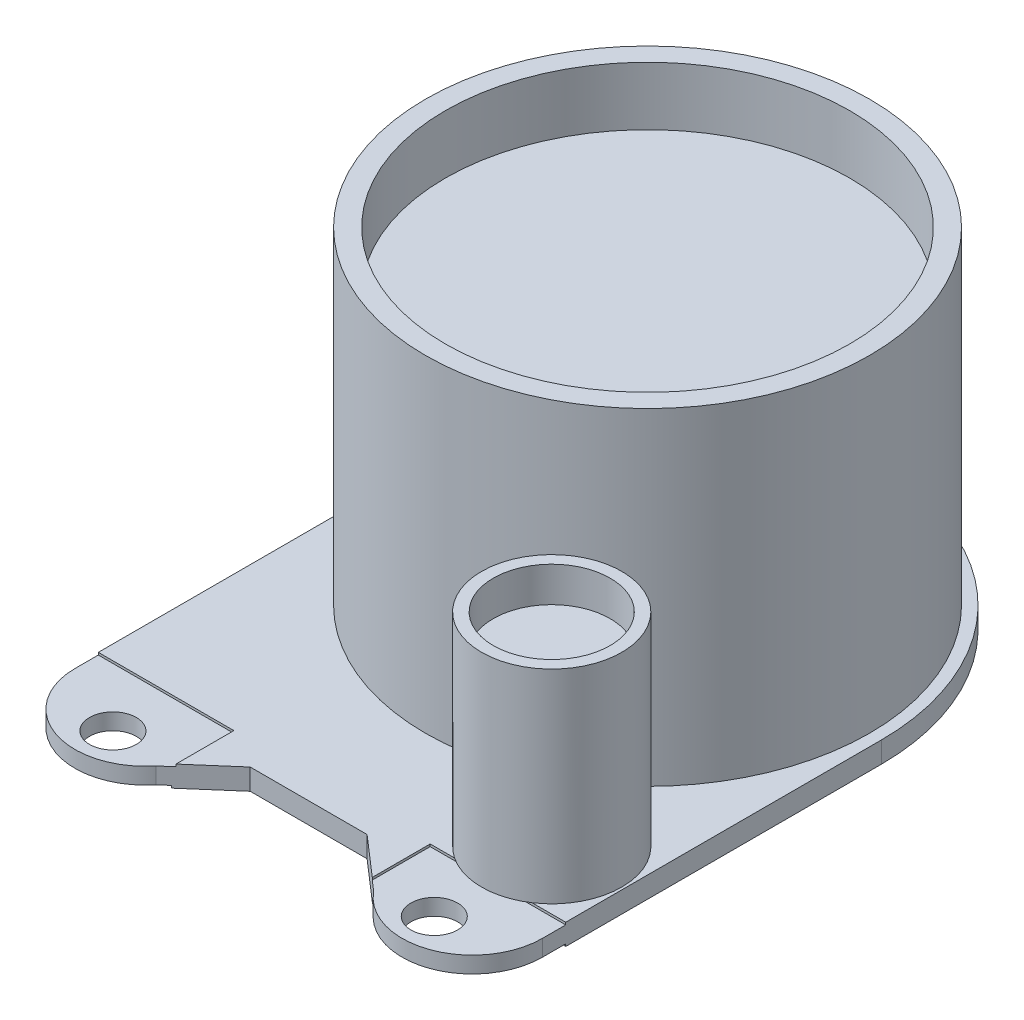
ISO-10303-21;
HEADER;
FILE_DESCRIPTION(('STEP AP214'),'2;1');
FILE_NAME('part.step','',(''),(''),'','','');
FILE_SCHEMA(('AUTOMOTIVE_DESIGN { 1 0 10303 214 1 1 1 1 }'));
ENDSEC;
DATA;
#1=APPLICATION_CONTEXT('core data for automotive mechanical design processes');
#2=APPLICATION_PROTOCOL_DEFINITION('international standard','automotive_design',2000,#1);
#3=PRODUCT_CONTEXT('',#1,'mechanical');
#4=PRODUCT('Part','Part','',(#3));
#5=PRODUCT_RELATED_PRODUCT_CATEGORY('part','',(#4));
#6=PRODUCT_DEFINITION_FORMATION('','',#4);
#7=PRODUCT_DEFINITION_CONTEXT('part definition',#1,'design');
#8=PRODUCT_DEFINITION('design','',#6,#7);
#9=PRODUCT_DEFINITION_SHAPE('','',#8);
#10=(LENGTH_UNIT() NAMED_UNIT(*) SI_UNIT(.MILLI.,.METRE.));
#11=(NAMED_UNIT(*) PLANE_ANGLE_UNIT() SI_UNIT($,.RADIAN.));
#12=(NAMED_UNIT(*) SI_UNIT($,.STERADIAN.) SOLID_ANGLE_UNIT());
#13=UNCERTAINTY_MEASURE_WITH_UNIT(LENGTH_MEASURE(1.E-05),#10,'distance_accuracy_value','');
#14=(GEOMETRIC_REPRESENTATION_CONTEXT(3) GLOBAL_UNCERTAINTY_ASSIGNED_CONTEXT((#13)) GLOBAL_UNIT_ASSIGNED_CONTEXT((#10,
#11,#12)) REPRESENTATION_CONTEXT('',''));
#15=CARTESIAN_POINT('',(0.,0.,0.));
#16=DIRECTION('',(0.,0.,1.));
#17=DIRECTION('',(1.,0.,0.));
#18=AXIS2_PLACEMENT_3D('',#15,#16,#17);
#19=CARTESIAN_POINT('',(-7.,0.9,14.5));
#20=DIRECTION('',(0.,-1.,0.));
#21=DIRECTION('',(0.,0.,-1.));
#22=AXIS2_PLACEMENT_3D('',#19,#20,#21);
#23=CYLINDRICAL_SURFACE('',#22,3.);
#24=CARTESIAN_POINT('',(-7.,0.8,14.5));
#25=DIRECTION('',(0.,1.,0.));
#26=DIRECTION('',(0.,0.,1.));
#27=AXIS2_PLACEMENT_3D('',#24,#25,#26);
#28=CIRCLE('',#27,3.);
#29=CARTESIAN_POINT('',(-10.,0.8,14.5));
#30=VERTEX_POINT('',#29);
#31=CARTESIAN_POINT('',(-4.66085191026748,0.8,16.3783999079804));
#32=VERTEX_POINT('',#31);
#33=EDGE_CURVE('E58',#30,#32,#28,.T.);
#34=ORIENTED_EDGE('',*,*,#33,.F.);
#35=DIRECTION('',(0.,-1.,0.));
#36=VECTOR('',#35,1.);
#37=CARTESIAN_POINT('',(-10.,0.9,14.5));
#38=LINE('',#37,#36);
#39=CARTESIAN_POINT('',(-10.,0.1,14.5));
#40=VERTEX_POINT('',#39);
#41=EDGE_CURVE('E372',#30,#40,#38,.T.);
#42=ORIENTED_EDGE('',*,*,#41,.T.);
#43=CARTESIAN_POINT('',(-7.,0.1,14.5));
#44=DIRECTION('',(0.,-1.,0.));
#45=DIRECTION('',(0.,0.,-1.));
#46=AXIS2_PLACEMENT_3D('',#43,#44,#45);
#47=CIRCLE('',#46,3.);
#48=CARTESIAN_POINT('',(-4.66085191026748,0.1,16.3783999079804));
#49=VERTEX_POINT('',#48);
#50=EDGE_CURVE('E299',#49,#40,#47,.T.);
#51=ORIENTED_EDGE('',*,*,#50,.F.);
#52=DIRECTION('',(0.,-1.,0.));
#53=VECTOR('',#52,1.);
#54=CARTESIAN_POINT('',(-4.66085191026748,0.9,16.3783999079804));
#55=LINE('',#54,#53);
#56=EDGE_CURVE('E370',#32,#49,#55,.T.);
#57=ORIENTED_EDGE('',*,*,#56,.F.);
#58=EDGE_LOOP('',(#34,#42,#51,#57));
#59=FACE_BOUND('',#58,.T.);
#60=ADVANCED_FACE('F43',(#59),#23,.T.);
#61=CARTESIAN_POINT('',(-6.875,0.9,16.));
#62=DIRECTION('',(0.,-1.,0.));
#63=DIRECTION('',(0.,0.,-1.));
#64=AXIS2_PLACEMENT_3D('',#61,#62,#63);
#65=CYLINDRICAL_SURFACE('',#64,1.);
#66=CARTESIAN_POINT('',(-6.875,0.1,16.));
#67=DIRECTION('',(0.,-1.,0.));
#68=DIRECTION('',(0.,0.,-1.));
#69=AXIS2_PLACEMENT_3D('',#66,#67,#68);
#70=CIRCLE('',#69,1.);
#71=CARTESIAN_POINT('',(-6.875,0.1,15.));
#72=VERTEX_POINT('',#71);
#73=EDGE_CURVE('E295',#72,#72,#70,.T.);
#74=ORIENTED_EDGE('',*,*,#73,.T.);
#75=EDGE_LOOP('',(#74));
#76=FACE_BOUND('',#75,.T.);
#77=CARTESIAN_POINT('',(-6.875,0.8,16.));
#78=DIRECTION('',(0.,1.,0.));
#79=DIRECTION('',(0.,0.,1.));
#80=AXIS2_PLACEMENT_3D('',#77,#78,#79);
#81=CIRCLE('',#80,1.);
#82=CARTESIAN_POINT('',(-6.875,0.8,17.));
#83=VERTEX_POINT('',#82);
#84=EDGE_CURVE('E244',#83,#83,#81,.T.);
#85=ORIENTED_EDGE('',*,*,#84,.T.);
#86=EDGE_LOOP('',(#85));
#87=FACE_BOUND('',#86,.T.);
#88=ADVANCED_FACE('F472',(#76,#87),#65,.F.);
#89=CARTESIAN_POINT('',(7.,0.9,14.5));
#90=DIRECTION('',(0.,-1.,0.));
#91=DIRECTION('',(0.,0.,-1.));
#92=AXIS2_PLACEMENT_3D('',#89,#90,#91);
#93=CYLINDRICAL_SURFACE('',#92,3.);
#94=DIRECTION('',(0.,-1.,0.));
#95=VECTOR('',#94,1.);
#96=CARTESIAN_POINT('',(10.,0.9,14.5));
#97=LINE('',#96,#95);
#98=CARTESIAN_POINT('',(10.,0.8,14.5));
#99=VERTEX_POINT('',#98);
#100=CARTESIAN_POINT('',(10.,0.1,14.5));
#101=VERTEX_POINT('',#100);
#102=EDGE_CURVE('E360',#99,#101,#97,.T.);
#103=ORIENTED_EDGE('',*,*,#102,.F.);
#104=CARTESIAN_POINT('',(7.,0.8,14.5));
#105=DIRECTION('',(0.,-1.,0.));
#106=DIRECTION('',(0.,0.,-1.));
#107=AXIS2_PLACEMENT_3D('',#104,#105,#106);
#108=CIRCLE('',#107,3.);
#109=CARTESIAN_POINT('',(4.66085191026748,0.8,16.3783999079804));
#110=VERTEX_POINT('',#109);
#111=EDGE_CURVE('E235',#99,#110,#108,.T.);
#112=ORIENTED_EDGE('',*,*,#111,.T.);
#113=DIRECTION('',(0.,-1.,0.));
#114=VECTOR('',#113,1.);
#115=CARTESIAN_POINT('',(4.66085191026748,0.9,16.3783999079804));
#116=LINE('',#115,#114);
#117=CARTESIAN_POINT('',(4.66085191026748,0.1,16.3783999079804));
#118=VERTEX_POINT('',#117);
#119=EDGE_CURVE('E362',#110,#118,#116,.T.);
#120=ORIENTED_EDGE('',*,*,#119,.T.);
#121=CARTESIAN_POINT('',(7.,0.1,14.5));
#122=DIRECTION('',(0.,-1.,0.));
#123=DIRECTION('',(0.,0.,-1.));
#124=AXIS2_PLACEMENT_3D('',#121,#122,#123);
#125=CIRCLE('',#124,3.);
#126=EDGE_CURVE('E289',#101,#118,#125,.T.);
#127=ORIENTED_EDGE('',*,*,#126,.F.);
#128=EDGE_LOOP('',(#103,#112,#120,#127));
#129=FACE_BOUND('',#128,.T.);
#130=ADVANCED_FACE('F438',(#129),#93,.T.);
#131=CARTESIAN_POINT('',(6.875,0.9,16.));
#132=DIRECTION('',(0.,-1.,0.));
#133=DIRECTION('',(0.,0.,-1.));
#134=AXIS2_PLACEMENT_3D('',#131,#132,#133);
#135=CYLINDRICAL_SURFACE('',#134,1.00000000000001);
#136=CARTESIAN_POINT('',(6.875,0.8,16.));
#137=DIRECTION('',(0.,-1.,0.));
#138=DIRECTION('',(0.,0.,-1.));
#139=AXIS2_PLACEMENT_3D('',#136,#137,#138);
#140=CIRCLE('',#139,1.00000000000001);
#141=CARTESIAN_POINT('',(6.875,0.8,15.));
#142=VERTEX_POINT('',#141);
#143=EDGE_CURVE('E239',#142,#142,#140,.T.);
#144=ORIENTED_EDGE('',*,*,#143,.F.);
#145=EDGE_LOOP('',(#144));
#146=FACE_BOUND('',#145,.T.);
#147=CARTESIAN_POINT('',(6.875,0.1,16.));
#148=DIRECTION('',(0.,-1.,0.));
#149=DIRECTION('',(0.,0.,-1.));
#150=AXIS2_PLACEMENT_3D('',#147,#148,#149);
#151=CIRCLE('',#150,1.00000000000001);
#152=CARTESIAN_POINT('',(6.875,0.1,15.));
#153=VERTEX_POINT('',#152);
#154=EDGE_CURVE('E264',#153,#153,#151,.T.);
#155=ORIENTED_EDGE('',*,*,#154,.T.);
#156=EDGE_LOOP('',(#155));
#157=FACE_BOUND('',#156,.T.);
#158=ADVANCED_FACE('F561',(#146,#157),#135,.F.);
#159=CARTESIAN_POINT('',(0.,0.9,0.));
#160=DIRECTION('',(0.,-1.,0.));
#161=DIRECTION('',(0.,0.,-1.));
#162=AXIS2_PLACEMENT_3D('',#159,#160,#161);
#163=PLANE('',#162);
#164=DIRECTION('',(0.,0.,1.));
#165=VECTOR('',#164,1.);
#166=CARTESIAN_POINT('',(-10.,0.9,0.));
#167=LINE('',#166,#165);
#168=CARTESIAN_POINT('',(-10.,0.9,0.));
#169=VERTEX_POINT('',#168);
#170=CARTESIAN_POINT('',(-10.,0.9,13.5));
#171=VERTEX_POINT('',#170);
#172=EDGE_CURVE('E331',#169,#171,#167,.T.);
#173=ORIENTED_EDGE('',*,*,#172,.T.);
#174=DIRECTION('',(-1.,0.,0.));
#175=VECTOR('',#174,1.);
#176=CARTESIAN_POINT('',(-10.,0.9,13.5));
#177=LINE('',#176,#175);
#178=CARTESIAN_POINT('',(-4.2,0.9,13.5));
#179=VERTEX_POINT('',#178);
#180=EDGE_CURVE('E211',#179,#171,#177,.T.);
#181=ORIENTED_EDGE('',*,*,#180,.F.);
#182=DIRECTION('',(0.,0.,-1.));
#183=VECTOR('',#182,1.);
#184=CARTESIAN_POINT('',(-4.2,0.9,13.5));
#185=LINE('',#184,#183);
#186=CARTESIAN_POINT('',(-4.2,0.9,15.9777874542876));
#187=VERTEX_POINT('',#186);
#188=EDGE_CURVE('E200',#187,#179,#185,.T.);
#189=ORIENTED_EDGE('',*,*,#188,.F.);
#190=DIRECTION('',(0.754709580222771,0.,-0.656059028990508));
#191=VECTOR('',#190,1.);
#192=CARTESIAN_POINT('',(-4.66085191026748,0.9,16.3783999079804));
#193=LINE('',#192,#191);
#194=CARTESIAN_POINT('',(-2.5,0.9,14.5));
#195=VERTEX_POINT('',#194);
#196=EDGE_CURVE('E335',#187,#195,#193,.T.);
#197=ORIENTED_EDGE('',*,*,#196,.T.);
#198=DIRECTION('',(1.,0.,0.));
#199=VECTOR('',#198,1.);
#200=CARTESIAN_POINT('',(-2.5,0.9,14.5));
#201=LINE('',#200,#199);
#202=CARTESIAN_POINT('',(2.5,0.9,14.5));
#203=VERTEX_POINT('',#202);
#204=EDGE_CURVE('E337',#195,#203,#201,.T.);
#205=ORIENTED_EDGE('',*,*,#204,.T.);
#206=DIRECTION('',(0.754709580222771,0.,0.656059028990509));
#207=VECTOR('',#206,1.);
#208=CARTESIAN_POINT('',(2.5,0.9,14.5));
#209=LINE('',#208,#207);
#210=CARTESIAN_POINT('',(4.2,0.9,15.9777874542876));
#211=VERTEX_POINT('',#210);
#212=EDGE_CURVE('E339',#203,#211,#209,.T.);
#213=ORIENTED_EDGE('',*,*,#212,.T.);
#214=DIRECTION('',(0.,0.,1.));
#215=VECTOR('',#214,1.);
#216=CARTESIAN_POINT('',(4.2,0.9,13.5));
#217=LINE('',#216,#215);
#218=CARTESIAN_POINT('',(4.2,0.9,13.5));
#219=VERTEX_POINT('',#218);
#220=EDGE_CURVE('E221',#219,#211,#217,.T.);
#221=ORIENTED_EDGE('',*,*,#220,.F.);
#222=DIRECTION('',(-1.,0.,0.));
#223=VECTOR('',#222,1.);
#224=CARTESIAN_POINT('',(10.,0.9,13.5));
#225=LINE('',#224,#223);
#226=CARTESIAN_POINT('',(5.2416876048223,0.9,13.5));
#227=VERTEX_POINT('',#226);
#228=EDGE_CURVE('E228',#227,#219,#225,.T.);
#229=ORIENTED_EDGE('',*,*,#228,.F.);
#230=CARTESIAN_POINT('',(6.9,0.9,11.));
#231=DIRECTION('',(0.,-1.,0.));
#232=DIRECTION('',(0.,0.,-1.));
#233=AXIS2_PLACEMENT_3D('',#230,#231,#232);
#234=CIRCLE('',#233,3.);
#235=CARTESIAN_POINT('',(8.55831239517769,0.9,13.5));
#236=VERTEX_POINT('',#235);
#237=EDGE_CURVE('E326',#236,#227,#234,.F.);
#238=ORIENTED_EDGE('',*,*,#237,.F.);
#239=CARTESIAN_POINT('',(10.,0.9,13.5));
#240=VERTEX_POINT('',#239);
#241=EDGE_CURVE('E67',#240,#236,#225,.T.);
#242=ORIENTED_EDGE('',*,*,#241,.F.);
#243=DIRECTION('',(0.,0.,-1.));
#244=VECTOR('',#243,1.);
#245=CARTESIAN_POINT('',(10.,0.9,0.));
#246=LINE('',#245,#244);
#247=CARTESIAN_POINT('',(10.,0.9,0.));
#248=VERTEX_POINT('',#247);
#249=EDGE_CURVE('E342',#240,#248,#246,.T.);
#250=ORIENTED_EDGE('',*,*,#249,.T.);
#251=CARTESIAN_POINT('',(0.,0.9,0.));
#252=DIRECTION('',(0.,1.,0.));
#253=DIRECTION('',(0.,0.,-1.));
#254=AXIS2_PLACEMENT_3D('',#251,#252,#253);
#255=CIRCLE('',#254,10.);
#256=EDGE_CURVE('E328',#248,#169,#255,.T.);
#257=ORIENTED_EDGE('',*,*,#256,.T.);
#258=EDGE_LOOP('',(#173,#181,#189,#197,#205,#213,#221,#229,#238,#242,#250,#257));
#259=FACE_BOUND('',#258,.T.);
#260=CARTESIAN_POINT('',(0.,0.9,0.));
#261=DIRECTION('',(0.,1.,0.));
#262=DIRECTION('',(0.,0.,1.));
#263=AXIS2_PLACEMENT_3D('',#260,#261,#262);
#264=CIRCLE('',#263,9.5);
#265=CARTESIAN_POINT('',(0.,0.9,9.5));
#266=VERTEX_POINT('',#265);
#267=EDGE_CURVE('E323',#266,#266,#264,.T.);
#268=ORIENTED_EDGE('',*,*,#267,.F.);
#269=EDGE_LOOP('',(#268));
#270=FACE_BOUND('',#269,.T.);
#271=ADVANCED_FACE('F404',(#259,#270),#163,.F.);
#272=CARTESIAN_POINT('',(0.,0.,0.));
#273=DIRECTION('',(0.,-1.,0.));
#274=DIRECTION('',(0.,0.,-1.));
#275=AXIS2_PLACEMENT_3D('',#272,#273,#274);
#276=PLANE('',#275);
#277=DIRECTION('',(0.,0.,1.));
#278=VECTOR('',#277,1.);
#279=CARTESIAN_POINT('',(-4.3,0.,18.5));
#280=LINE('',#279,#278);
#281=CARTESIAN_POINT('',(-4.3,0.,13.5));
#282=VERTEX_POINT('',#281);
#283=CARTESIAN_POINT('',(-4.3,0.,16.0647161280692));
#284=VERTEX_POINT('',#283);
#285=EDGE_CURVE('E251',#282,#284,#280,.T.);
#286=ORIENTED_EDGE('',*,*,#285,.F.);
#287=DIRECTION('',(1.,0.,0.));
#288=VECTOR('',#287,1.);
#289=CARTESIAN_POINT('',(-10.,0.,13.5));
#290=LINE('',#289,#288);
#291=CARTESIAN_POINT('',(-10.,0.,13.5));
#292=VERTEX_POINT('',#291);
#293=EDGE_CURVE('E257',#292,#282,#290,.T.);
#294=ORIENTED_EDGE('',*,*,#293,.F.);
#295=DIRECTION('',(0.,0.,1.));
#296=VECTOR('',#295,1.);
#297=CARTESIAN_POINT('',(-10.,0.,0.));
#298=LINE('',#297,#296);
#299=CARTESIAN_POINT('',(-10.,0.,0.));
#300=VERTEX_POINT('',#299);
#301=EDGE_CURVE('E347',#300,#292,#298,.T.);
#302=ORIENTED_EDGE('',*,*,#301,.F.);
#303=CARTESIAN_POINT('',(0.,0.,0.));
#304=DIRECTION('',(0.,1.,0.));
#305=DIRECTION('',(0.,0.,-1.));
#306=AXIS2_PLACEMENT_3D('',#303,#304,#305);
#307=CIRCLE('',#306,10.);
#308=CARTESIAN_POINT('',(10.,0.,0.));
#309=VERTEX_POINT('',#308);
#310=EDGE_CURVE('E322',#309,#300,#307,.T.);
#311=ORIENTED_EDGE('',*,*,#310,.F.);
#312=DIRECTION('',(0.,0.,-1.));
#313=VECTOR('',#312,1.);
#314=CARTESIAN_POINT('',(10.,0.,0.));
#315=LINE('',#314,#313);
#316=CARTESIAN_POINT('',(10.,0.,13.5));
#317=VERTEX_POINT('',#316);
#318=EDGE_CURVE('E332',#317,#309,#315,.T.);
#319=ORIENTED_EDGE('',*,*,#318,.F.);
#320=DIRECTION('',(1.,0.,0.));
#321=VECTOR('',#320,1.);
#322=CARTESIAN_POINT('',(4.3,0.,13.5));
#323=LINE('',#322,#321);
#324=CARTESIAN_POINT('',(4.3,0.,13.5));
#325=VERTEX_POINT('',#324);
#326=EDGE_CURVE('E269',#325,#317,#323,.T.);
#327=ORIENTED_EDGE('',*,*,#326,.F.);
#328=DIRECTION('',(0.,0.,-1.));
#329=VECTOR('',#328,1.);
#330=CARTESIAN_POINT('',(4.3,0.,18.5));
#331=LINE('',#330,#329);
#332=CARTESIAN_POINT('',(4.3,0.,16.0647161280692));
#333=VERTEX_POINT('',#332);
#334=EDGE_CURVE('E276',#333,#325,#331,.T.);
#335=ORIENTED_EDGE('',*,*,#334,.F.);
#336=DIRECTION('',(0.754709580222771,0.,0.656059028990509));
#337=VECTOR('',#336,1.);
#338=CARTESIAN_POINT('',(2.5,0.,14.5));
#339=LINE('',#338,#337);
#340=CARTESIAN_POINT('',(2.5,0.,14.5));
#341=VERTEX_POINT('',#340);
#342=EDGE_CURVE('E354',#341,#333,#339,.T.);
#343=ORIENTED_EDGE('',*,*,#342,.F.);
#344=DIRECTION('',(1.,0.,0.));
#345=VECTOR('',#344,1.);
#346=CARTESIAN_POINT('',(-2.5,0.,14.5));
#347=LINE('',#346,#345);
#348=CARTESIAN_POINT('',(-2.5,0.,14.5));
#349=VERTEX_POINT('',#348);
#350=EDGE_CURVE('E352',#349,#341,#347,.T.);
#351=ORIENTED_EDGE('',*,*,#350,.F.);
#352=DIRECTION('',(0.754709580222771,0.,-0.656059028990508));
#353=VECTOR('',#352,1.);
#354=CARTESIAN_POINT('',(-4.66085191026748,0.,16.3783999079804));
#355=LINE('',#354,#353);
#356=EDGE_CURVE('E350',#284,#349,#355,.T.);
#357=ORIENTED_EDGE('',*,*,#356,.F.);
#358=EDGE_LOOP('',(#286,#294,#302,#311,#319,#327,#335,#343,#351,#357));
#359=FACE_BOUND('',#358,.T.);
#360=CARTESIAN_POINT('',(0.,0.,0.));
#361=DIRECTION('',(0.,-1.,0.));
#362=DIRECTION('',(0.,0.,-1.));
#363=AXIS2_PLACEMENT_3D('',#360,#361,#362);
#364=CIRCLE('',#363,4.25);
#365=CARTESIAN_POINT('',(0.,0.,-4.25));
#366=VERTEX_POINT('',#365);
#367=EDGE_CURVE('E247',#366,#366,#364,.T.);
#368=ORIENTED_EDGE('',*,*,#367,.F.);
#369=EDGE_LOOP('',(#368));
#370=FACE_BOUND('',#369,.T.);
#371=ADVANCED_FACE('F418',(#359,#370),#276,.T.);
#372=CARTESIAN_POINT('',(0.,0.9,0.));
#373=DIRECTION('',(0.,-1.,0.));
#374=DIRECTION('',(0.,0.,-1.));
#375=AXIS2_PLACEMENT_3D('',#372,#373,#374);
#376=CYLINDRICAL_SURFACE('',#375,10.);
#377=ORIENTED_EDGE('',*,*,#310,.T.);
#378=DIRECTION('',(0.,-1.,0.));
#379=VECTOR('',#378,1.);
#380=CARTESIAN_POINT('',(-10.,0.9,0.));
#381=LINE('',#380,#379);
#382=EDGE_CURVE('E327',#169,#300,#381,.T.);
#383=ORIENTED_EDGE('',*,*,#382,.F.);
#384=ORIENTED_EDGE('',*,*,#256,.F.);
#385=DIRECTION('',(0.,-1.,0.));
#386=VECTOR('',#385,1.);
#387=CARTESIAN_POINT('',(10.,0.9,0.));
#388=LINE('',#387,#386);
#389=EDGE_CURVE('E344',#248,#309,#388,.T.);
#390=ORIENTED_EDGE('',*,*,#389,.T.);
#391=EDGE_LOOP('',(#377,#383,#384,#390));
#392=FACE_BOUND('',#391,.T.);
#393=ADVANCED_FACE('F45',(#392),#376,.T.);
#394=CARTESIAN_POINT('',(-10.,0.9,0.));
#395=DIRECTION('',(1.,0.,0.));
#396=DIRECTION('',(0.,0.,-1.));
#397=AXIS2_PLACEMENT_3D('',#394,#395,#396);
#398=PLANE('',#397);
#399=DIRECTION('',(0.,0.,1.));
#400=VECTOR('',#399,1.);
#401=CARTESIAN_POINT('',(-10.,0.8,13.5));
#402=LINE('',#401,#400);
#403=CARTESIAN_POINT('',(-10.,0.8,13.5));
#404=VERTEX_POINT('',#403);
#405=EDGE_CURVE('E194',#404,#30,#402,.T.);
#406=ORIENTED_EDGE('',*,*,#405,.F.);
#407=DIRECTION('',(0.,1.,0.));
#408=VECTOR('',#407,1.);
#409=CARTESIAN_POINT('',(-10.,0.8,13.5));
#410=LINE('',#409,#408);
#411=EDGE_CURVE('E203',#404,#171,#410,.T.);
#412=ORIENTED_EDGE('',*,*,#411,.T.);
#413=ORIENTED_EDGE('',*,*,#172,.F.);
#414=ORIENTED_EDGE('',*,*,#382,.T.);
#415=ORIENTED_EDGE('',*,*,#301,.T.);
#416=DIRECTION('',(0.,-1.,0.));
#417=VECTOR('',#416,1.);
#418=CARTESIAN_POINT('',(-10.,0.1,13.5));
#419=LINE('',#418,#417);
#420=CARTESIAN_POINT('',(-10.,0.1,13.5));
#421=VERTEX_POINT('',#420);
#422=EDGE_CURVE('E256',#421,#292,#419,.T.);
#423=ORIENTED_EDGE('',*,*,#422,.F.);
#424=DIRECTION('',(0.,0.,-1.));
#425=VECTOR('',#424,1.);
#426=CARTESIAN_POINT('',(-10.,0.1,18.5));
#427=LINE('',#426,#425);
#428=EDGE_CURVE('E248',#40,#421,#427,.T.);
#429=ORIENTED_EDGE('',*,*,#428,.F.);
#430=ORIENTED_EDGE('',*,*,#41,.F.);
#431=EDGE_LOOP('',(#406,#412,#413,#414,#415,#423,#429,#430));
#432=FACE_BOUND('',#431,.T.);
#433=ADVANCED_FACE('F483',(#432),#398,.F.);
#434=CARTESIAN_POINT('',(-4.66085191026748,0.9,16.3783999079804));
#435=DIRECTION('',(-0.656059028990508,0.,-0.754709580222771));
#436=DIRECTION('',(-0.754709580222771,0.,0.656059028990508));
#437=AXIS2_PLACEMENT_3D('',#434,#435,#436);
#438=PLANE('',#437);
#439=ORIENTED_EDGE('',*,*,#196,.F.);
#440=DIRECTION('',(0.,-1.,0.));
#441=VECTOR('',#440,1.);
#442=CARTESIAN_POINT('',(-4.2,0.9,15.9777874542876));
#443=LINE('',#442,#441);
#444=CARTESIAN_POINT('',(-4.2,0.8,15.9777874542876));
#445=VERTEX_POINT('',#444);
#446=EDGE_CURVE('E11',#187,#445,#443,.T.);
#447=ORIENTED_EDGE('',*,*,#446,.T.);
#448=DIRECTION('',(0.754709580222771,0.,-0.656059028990508));
#449=VECTOR('',#448,1.);
#450=CARTESIAN_POINT('',(-4.66085191026748,0.8,16.3783999079804));
#451=LINE('',#450,#449);
#452=EDGE_CURVE('E51',#32,#445,#451,.T.);
#453=ORIENTED_EDGE('',*,*,#452,.F.);
#454=ORIENTED_EDGE('',*,*,#56,.T.);
#455=DIRECTION('',(-0.754709580222771,0.,0.656059028990508));
#456=VECTOR('',#455,1.);
#457=CARTESIAN_POINT('',(-4.66085191026748,0.1,16.3783999079804));
#458=LINE('',#457,#456);
#459=CARTESIAN_POINT('',(-4.3,0.1,16.0647161280692));
#460=VERTEX_POINT('',#459);
#461=EDGE_CURVE('E296',#460,#49,#458,.T.);
#462=ORIENTED_EDGE('',*,*,#461,.F.);
#463=DIRECTION('',(0.,-1.,0.));
#464=VECTOR('',#463,1.);
#465=CARTESIAN_POINT('',(-4.3,0.9,16.0647161280692));
#466=LINE('',#465,#464);
#467=EDGE_CURVE('E388',#460,#284,#466,.T.);
#468=ORIENTED_EDGE('',*,*,#467,.T.);
#469=ORIENTED_EDGE('',*,*,#356,.T.);
#470=DIRECTION('',(0.,-1.,0.));
#471=VECTOR('',#470,1.);
#472=CARTESIAN_POINT('',(-2.5,0.9,14.5));
#473=LINE('',#472,#471);
#474=EDGE_CURVE('E367',#195,#349,#473,.T.);
#475=ORIENTED_EDGE('',*,*,#474,.F.);
#476=EDGE_LOOP('',(#439,#447,#453,#454,#462,#468,#469,#475));
#477=FACE_BOUND('',#476,.T.);
#478=ADVANCED_FACE('F481',(#477),#438,.F.);
#479=CARTESIAN_POINT('',(-2.5,0.9,14.5));
#480=DIRECTION('',(0.,0.,-1.));
#481=DIRECTION('',(-1.,0.,0.));
#482=AXIS2_PLACEMENT_3D('',#479,#480,#481);
#483=PLANE('',#482);
#484=ORIENTED_EDGE('',*,*,#350,.T.);
#485=DIRECTION('',(0.,-1.,0.));
#486=VECTOR('',#485,1.);
#487=CARTESIAN_POINT('',(2.5,0.9,14.5));
#488=LINE('',#487,#486);
#489=EDGE_CURVE('E364',#203,#341,#488,.T.);
#490=ORIENTED_EDGE('',*,*,#489,.F.);
#491=ORIENTED_EDGE('',*,*,#204,.F.);
#492=ORIENTED_EDGE('',*,*,#474,.T.);
#493=EDGE_LOOP('',(#484,#490,#491,#492));
#494=FACE_BOUND('',#493,.T.);
#495=ADVANCED_FACE('F412',(#494),#483,.F.);
#496=CARTESIAN_POINT('',(2.5,0.9,14.5));
#497=DIRECTION('',(0.656059028990509,0.,-0.754709580222771));
#498=DIRECTION('',(-0.754709580222771,0.,-0.656059028990509));
#499=AXIS2_PLACEMENT_3D('',#496,#497,#498);
#500=PLANE('',#499);
#501=DIRECTION('',(-0.754709580222771,0.,-0.656059028990509));
#502=VECTOR('',#501,1.);
#503=CARTESIAN_POINT('',(2.5,0.8,14.5));
#504=LINE('',#503,#502);
#505=CARTESIAN_POINT('',(4.2,0.8,15.9777874542876));
#506=VERTEX_POINT('',#505);
#507=EDGE_CURVE('E214',#110,#506,#504,.T.);
#508=ORIENTED_EDGE('',*,*,#507,.T.);
#509=DIRECTION('',(0.,1.,0.));
#510=VECTOR('',#509,1.);
#511=CARTESIAN_POINT('',(4.2,0.9,15.9777874542876));
#512=LINE('',#511,#510);
#513=EDGE_CURVE('E394',#506,#211,#512,.T.);
#514=ORIENTED_EDGE('',*,*,#513,.T.);
#515=ORIENTED_EDGE('',*,*,#212,.F.);
#516=ORIENTED_EDGE('',*,*,#489,.T.);
#517=ORIENTED_EDGE('',*,*,#342,.T.);
#518=DIRECTION('',(0.,1.,0.));
#519=VECTOR('',#518,1.);
#520=CARTESIAN_POINT('',(4.3,0.9,16.0647161280692));
#521=LINE('',#520,#519);
#522=CARTESIAN_POINT('',(4.3,0.1,16.0647161280692));
#523=VERTEX_POINT('',#522);
#524=EDGE_CURVE('E380',#333,#523,#521,.T.);
#525=ORIENTED_EDGE('',*,*,#524,.T.);
#526=DIRECTION('',(-0.754709580222771,0.,-0.656059028990509));
#527=VECTOR('',#526,1.);
#528=CARTESIAN_POINT('',(2.5,0.1,14.5));
#529=LINE('',#528,#527);
#530=EDGE_CURVE('E293',#118,#523,#529,.T.);
#531=ORIENTED_EDGE('',*,*,#530,.F.);
#532=ORIENTED_EDGE('',*,*,#119,.F.);
#533=EDGE_LOOP('',(#508,#514,#515,#516,#517,#525,#531,#532));
#534=FACE_BOUND('',#533,.T.);
#535=ADVANCED_FACE('F398',(#534),#500,.F.);
#536=CARTESIAN_POINT('',(10.,0.9,0.));
#537=DIRECTION('',(-1.,0.,0.));
#538=DIRECTION('',(0.,0.,1.));
#539=AXIS2_PLACEMENT_3D('',#536,#537,#538);
#540=PLANE('',#539);
#541=ORIENTED_EDGE('',*,*,#249,.F.);
#542=DIRECTION('',(0.,1.,0.));
#543=VECTOR('',#542,1.);
#544=CARTESIAN_POINT('',(10.,0.8,13.5));
#545=LINE('',#544,#543);
#546=CARTESIAN_POINT('',(10.,0.8,13.5));
#547=VERTEX_POINT('',#546);
#548=EDGE_CURVE('E224',#547,#240,#545,.T.);
#549=ORIENTED_EDGE('',*,*,#548,.F.);
#550=DIRECTION('',(0.,0.,1.));
#551=VECTOR('',#550,1.);
#552=CARTESIAN_POINT('',(10.,0.8,0.));
#553=LINE('',#552,#551);
#554=EDGE_CURVE('E391',#547,#99,#553,.T.);
#555=ORIENTED_EDGE('',*,*,#554,.T.);
#556=ORIENTED_EDGE('',*,*,#102,.T.);
#557=DIRECTION('',(0.,0.,1.));
#558=VECTOR('',#557,1.);
#559=CARTESIAN_POINT('',(10.,0.1,18.5));
#560=LINE('',#559,#558);
#561=CARTESIAN_POINT('',(10.,0.1,13.5));
#562=VERTEX_POINT('',#561);
#563=EDGE_CURVE('E272',#562,#101,#560,.T.);
#564=ORIENTED_EDGE('',*,*,#563,.F.);
#565=DIRECTION('',(0.,-1.,0.));
#566=VECTOR('',#565,1.);
#567=CARTESIAN_POINT('',(10.,0.1,13.5));
#568=LINE('',#567,#566);
#569=EDGE_CURVE('E260',#562,#317,#568,.T.);
#570=ORIENTED_EDGE('',*,*,#569,.T.);
#571=ORIENTED_EDGE('',*,*,#318,.T.);
#572=ORIENTED_EDGE('',*,*,#389,.F.);
#573=EDGE_LOOP('',(#541,#549,#555,#556,#564,#570,#571,#572));
#574=FACE_BOUND('',#573,.T.);
#575=ADVANCED_FACE('F445',(#574),#540,.F.);
#576=CARTESIAN_POINT('',(0.,14.9,0.));
#577=DIRECTION('',(0.,-1.,0.));
#578=DIRECTION('',(0.,0.,-1.));
#579=AXIS2_PLACEMENT_3D('',#576,#577,#578);
#580=CYLINDRICAL_SURFACE('',#579,9.5);
#581=CARTESIAN_POINT('',(0.,14.9,0.));
#582=DIRECTION('',(0.,1.,0.));
#583=DIRECTION('',(0.,0.,1.));
#584=AXIS2_PLACEMENT_3D('',#581,#582,#583);
#585=CIRCLE('',#584,9.5);
#586=CARTESIAN_POINT('',(0.,14.9,9.5));
#587=VERTEX_POINT('',#586);
#588=EDGE_CURVE('E317',#587,#587,#585,.T.);
#589=ORIENTED_EDGE('',*,*,#588,.F.);
#590=EDGE_LOOP('',(#589));
#591=FACE_BOUND('',#590,.T.);
#592=ORIENTED_EDGE('',*,*,#267,.T.);
#593=EDGE_LOOP('',(#592));
#594=FACE_BOUND('',#593,.T.);
#595=ADVANCED_FACE('F556',(#591,#594),#580,.T.);
#596=CARTESIAN_POINT('',(0.,14.9,0.));
#597=DIRECTION('',(0.,1.,0.));
#598=DIRECTION('',(0.,0.,1.));
#599=AXIS2_PLACEMENT_3D('',#596,#597,#598);
#600=PLANE('',#599);
#601=CARTESIAN_POINT('',(0.,14.9,0.));
#602=DIRECTION('',(0.,1.,0.));
#603=DIRECTION('',(0.,0.,1.));
#604=AXIS2_PLACEMENT_3D('',#601,#602,#603);
#605=CIRCLE('',#604,8.65);
#606=CARTESIAN_POINT('',(0.,14.9,8.65));
#607=VERTEX_POINT('',#606);
#608=EDGE_CURVE('E313',#607,#607,#605,.T.);
#609=ORIENTED_EDGE('',*,*,#608,.F.);
#610=EDGE_LOOP('',(#609));
#611=FACE_BOUND('',#610,.T.);
#612=ORIENTED_EDGE('',*,*,#588,.T.);
#613=EDGE_LOOP('',(#612));
#614=FACE_BOUND('',#613,.T.);
#615=ADVANCED_FACE('F552',(#611,#614),#600,.T.);
#616=CARTESIAN_POINT('',(0.,12.4,0.));
#617=DIRECTION('',(0.,1.,0.));
#618=DIRECTION('',(0.,0.,1.));
#619=AXIS2_PLACEMENT_3D('',#616,#617,#618);
#620=CYLINDRICAL_SURFACE('',#619,8.65);
#621=CARTESIAN_POINT('',(0.,12.4,0.));
#622=DIRECTION('',(0.,1.,0.));
#623=DIRECTION('',(0.,0.,1.));
#624=AXIS2_PLACEMENT_3D('',#621,#622,#623);
#625=CIRCLE('',#624,8.65);
#626=CARTESIAN_POINT('',(0.,12.4,8.65));
#627=VERTEX_POINT('',#626);
#628=EDGE_CURVE('E314',#627,#627,#625,.T.);
#629=ORIENTED_EDGE('',*,*,#628,.F.);
#630=EDGE_LOOP('',(#629));
#631=FACE_BOUND('',#630,.T.);
#632=ORIENTED_EDGE('',*,*,#608,.T.);
#633=EDGE_LOOP('',(#632));
#634=FACE_BOUND('',#633,.T.);
#635=ADVANCED_FACE('F548',(#631,#634),#620,.F.);
#636=CARTESIAN_POINT('',(0.,12.4,0.));
#637=DIRECTION('',(0.,1.,0.));
#638=DIRECTION('',(0.,0.,1.));
#639=AXIS2_PLACEMENT_3D('',#636,#637,#638);
#640=PLANE('',#639);
#641=ORIENTED_EDGE('',*,*,#628,.T.);
#642=EDGE_LOOP('',(#641));
#643=FACE_BOUND('',#642,.T.);
#644=ADVANCED_FACE('F544',(#643),#640,.T.);
#645=CARTESIAN_POINT('',(6.9,9.6,11.));
#646=DIRECTION('',(0.,-1.,0.));
#647=DIRECTION('',(0.,0.,-1.));
#648=AXIS2_PLACEMENT_3D('',#645,#646,#647);
#649=CYLINDRICAL_SURFACE('',#648,3.);
#650=CARTESIAN_POINT('',(6.9,9.6,11.));
#651=DIRECTION('',(0.,1.,0.));
#652=DIRECTION('',(0.,0.,1.));
#653=AXIS2_PLACEMENT_3D('',#650,#651,#652);
#654=CIRCLE('',#653,3.);
#655=CARTESIAN_POINT('',(6.9,9.6,14.));
#656=VERTEX_POINT('',#655);
#657=EDGE_CURVE('E307',#656,#656,#654,.T.);
#658=ORIENTED_EDGE('',*,*,#657,.F.);
#659=EDGE_LOOP('',(#658));
#660=FACE_BOUND('',#659,.T.);
#661=EDGE_CURVE('E376',#227,#236,#234,.F.);
#662=ORIENTED_EDGE('',*,*,#661,.T.);
#663=ORIENTED_EDGE('',*,*,#237,.T.);
#664=EDGE_LOOP('',(#662,#663));
#665=FACE_BOUND('',#664,.T.);
#666=ADVANCED_FACE('F452',(#660,#665),#649,.T.);
#667=CARTESIAN_POINT('',(6.9,9.6,11.));
#668=DIRECTION('',(0.,1.,0.));
#669=DIRECTION('',(0.,0.,1.));
#670=AXIS2_PLACEMENT_3D('',#667,#668,#669);
#671=PLANE('',#670);
#672=CARTESIAN_POINT('',(6.9,9.6,11.));
#673=DIRECTION('',(0.,1.,0.));
#674=DIRECTION('',(0.,0.,1.));
#675=AXIS2_PLACEMENT_3D('',#672,#673,#674);
#676=CIRCLE('',#675,2.5);
#677=CARTESIAN_POINT('',(6.9,9.6,13.5));
#678=VERTEX_POINT('',#677);
#679=EDGE_CURVE('E302',#678,#678,#676,.T.);
#680=ORIENTED_EDGE('',*,*,#679,.F.);
#681=EDGE_LOOP('',(#680));
#682=FACE_BOUND('',#681,.T.);
#683=ORIENTED_EDGE('',*,*,#657,.T.);
#684=EDGE_LOOP('',(#683));
#685=FACE_BOUND('',#684,.T.);
#686=ADVANCED_FACE('F537',(#682,#685),#671,.T.);
#687=CARTESIAN_POINT('',(6.9,8.1,11.));
#688=DIRECTION('',(0.,1.,0.));
#689=DIRECTION('',(0.,0.,1.));
#690=AXIS2_PLACEMENT_3D('',#687,#688,#689);
#691=CYLINDRICAL_SURFACE('',#690,2.5);
#692=CARTESIAN_POINT('',(6.9,8.1,11.));
#693=DIRECTION('',(0.,1.,0.));
#694=DIRECTION('',(0.,0.,1.));
#695=AXIS2_PLACEMENT_3D('',#692,#693,#694);
#696=CIRCLE('',#695,2.5);
#697=CARTESIAN_POINT('',(6.9,8.1,13.5));
#698=VERTEX_POINT('',#697);
#699=EDGE_CURVE('E303',#698,#698,#696,.T.);
#700=ORIENTED_EDGE('',*,*,#699,.F.);
#701=EDGE_LOOP('',(#700));
#702=FACE_BOUND('',#701,.T.);
#703=ORIENTED_EDGE('',*,*,#679,.T.);
#704=EDGE_LOOP('',(#703));
#705=FACE_BOUND('',#704,.T.);
#706=ADVANCED_FACE('F533',(#702,#705),#691,.F.);
#707=CARTESIAN_POINT('',(6.9,8.1,11.));
#708=DIRECTION('',(0.,1.,0.));
#709=DIRECTION('',(0.,0.,1.));
#710=AXIS2_PLACEMENT_3D('',#707,#708,#709);
#711=PLANE('',#710);
#712=ORIENTED_EDGE('',*,*,#699,.T.);
#713=EDGE_LOOP('',(#712));
#714=FACE_BOUND('',#713,.T.);
#715=ADVANCED_FACE('F529',(#714),#711,.T.);
#716=CARTESIAN_POINT('',(4.3,0.1,18.5));
#717=DIRECTION('',(-1.,0.,0.));
#718=DIRECTION('',(0.,0.,1.));
#719=AXIS2_PLACEMENT_3D('',#716,#717,#718);
#720=PLANE('',#719);
#721=ORIENTED_EDGE('',*,*,#334,.T.);
#722=DIRECTION('',(0.,-1.,0.));
#723=VECTOR('',#722,1.);
#724=CARTESIAN_POINT('',(4.3,0.1,13.5));
#725=LINE('',#724,#723);
#726=CARTESIAN_POINT('',(4.3,0.1,13.5));
#727=VERTEX_POINT('',#726);
#728=EDGE_CURVE('E275',#727,#325,#725,.T.);
#729=ORIENTED_EDGE('',*,*,#728,.F.);
#730=DIRECTION('',(0.,0.,-1.));
#731=VECTOR('',#730,1.);
#732=CARTESIAN_POINT('',(4.3,0.1,18.5));
#733=LINE('',#732,#731);
#734=EDGE_CURVE('E266',#523,#727,#733,.T.);
#735=ORIENTED_EDGE('',*,*,#734,.F.);
#736=ORIENTED_EDGE('',*,*,#524,.F.);
#737=EDGE_LOOP('',(#721,#729,#735,#736));
#738=FACE_BOUND('',#737,.T.);
#739=ADVANCED_FACE('F425',(#738),#720,.F.);
#740=CARTESIAN_POINT('',(0.,0.1,0.));
#741=DIRECTION('',(0.,-1.,0.));
#742=DIRECTION('',(0.,0.,-1.));
#743=AXIS2_PLACEMENT_3D('',#740,#741,#742);
#744=PLANE('',#743);
#745=ORIENTED_EDGE('',*,*,#154,.F.);
#746=EDGE_LOOP('',(#745));
#747=FACE_BOUND('',#746,.T.);
#748=ORIENTED_EDGE('',*,*,#530,.T.);
#749=ORIENTED_EDGE('',*,*,#734,.T.);
#750=DIRECTION('',(1.,0.,0.));
#751=VECTOR('',#750,1.);
#752=CARTESIAN_POINT('',(4.3,0.1,13.5));
#753=LINE('',#752,#751);
#754=EDGE_CURVE('E268',#727,#562,#753,.T.);
#755=ORIENTED_EDGE('',*,*,#754,.T.);
#756=ORIENTED_EDGE('',*,*,#563,.T.);
#757=ORIENTED_EDGE('',*,*,#126,.T.);
#758=EDGE_LOOP('',(#748,#749,#755,#756,#757));
#759=FACE_BOUND('',#758,.T.);
#760=ADVANCED_FACE('F433',(#747,#759),#744,.T.);
#761=CARTESIAN_POINT('',(4.3,0.1,13.5));
#762=DIRECTION('',(0.,0.,-1.));
#763=DIRECTION('',(-1.,0.,0.));
#764=AXIS2_PLACEMENT_3D('',#761,#762,#763);
#765=PLANE('',#764);
#766=ORIENTED_EDGE('',*,*,#326,.T.);
#767=ORIENTED_EDGE('',*,*,#569,.F.);
#768=ORIENTED_EDGE('',*,*,#754,.F.);
#769=ORIENTED_EDGE('',*,*,#728,.T.);
#770=EDGE_LOOP('',(#766,#767,#768,#769));
#771=FACE_BOUND('',#770,.T.);
#772=ADVANCED_FACE('F429',(#771),#765,.F.);
#773=CARTESIAN_POINT('',(-4.3,0.1,18.5));
#774=DIRECTION('',(1.,0.,0.));
#775=DIRECTION('',(0.,0.,-1.));
#776=AXIS2_PLACEMENT_3D('',#773,#774,#775);
#777=PLANE('',#776);
#778=DIRECTION('',(0.,0.,1.));
#779=VECTOR('',#778,1.);
#780=CARTESIAN_POINT('',(-4.3,0.1,18.5));
#781=LINE('',#780,#779);
#782=CARTESIAN_POINT('',(-4.3,0.1,13.5));
#783=VERTEX_POINT('',#782);
#784=EDGE_CURVE('E254',#783,#460,#781,.T.);
#785=ORIENTED_EDGE('',*,*,#784,.F.);
#786=DIRECTION('',(0.,-1.,0.));
#787=VECTOR('',#786,1.);
#788=CARTESIAN_POINT('',(-4.3,0.1,13.5));
#789=LINE('',#788,#787);
#790=EDGE_CURVE('E262',#783,#282,#789,.T.);
#791=ORIENTED_EDGE('',*,*,#790,.T.);
#792=ORIENTED_EDGE('',*,*,#285,.T.);
#793=ORIENTED_EDGE('',*,*,#467,.F.);
#794=EDGE_LOOP('',(#785,#791,#792,#793));
#795=FACE_BOUND('',#794,.T.);
#796=ADVANCED_FACE('F503',(#795),#777,.F.);
#797=CARTESIAN_POINT('',(0.,0.1,0.));
#798=DIRECTION('',(0.,-1.,0.));
#799=DIRECTION('',(0.,0.,-1.));
#800=AXIS2_PLACEMENT_3D('',#797,#798,#799);
#801=PLANE('',#800);
#802=ORIENTED_EDGE('',*,*,#73,.F.);
#803=EDGE_LOOP('',(#802));
#804=FACE_BOUND('',#803,.T.);
#805=ORIENTED_EDGE('',*,*,#50,.T.);
#806=ORIENTED_EDGE('',*,*,#428,.T.);
#807=DIRECTION('',(1.,0.,0.));
#808=VECTOR('',#807,1.);
#809=CARTESIAN_POINT('',(-10.,0.1,13.5));
#810=LINE('',#809,#808);
#811=EDGE_CURVE('E250',#421,#783,#810,.T.);
#812=ORIENTED_EDGE('',*,*,#811,.T.);
#813=ORIENTED_EDGE('',*,*,#784,.T.);
#814=ORIENTED_EDGE('',*,*,#461,.T.);
#815=EDGE_LOOP('',(#805,#806,#812,#813,#814));
#816=FACE_BOUND('',#815,.T.);
#817=ADVANCED_FACE('F498',(#804,#816),#801,.T.);
#818=CARTESIAN_POINT('',(-10.,0.1,13.5));
#819=DIRECTION('',(0.,0.,-1.));
#820=DIRECTION('',(-1.,0.,0.));
#821=AXIS2_PLACEMENT_3D('',#818,#819,#820);
#822=PLANE('',#821);
#823=ORIENTED_EDGE('',*,*,#293,.T.);
#824=ORIENTED_EDGE('',*,*,#790,.F.);
#825=ORIENTED_EDGE('',*,*,#811,.F.);
#826=ORIENTED_EDGE('',*,*,#422,.T.);
#827=EDGE_LOOP('',(#823,#824,#825,#826));
#828=FACE_BOUND('',#827,.T.);
#829=ADVANCED_FACE('F510',(#828),#822,.F.);
#830=CARTESIAN_POINT('',(0.,0.1,0.));
#831=DIRECTION('',(0.,-1.,0.));
#832=DIRECTION('',(0.,0.,-1.));
#833=AXIS2_PLACEMENT_3D('',#830,#831,#832);
#834=CYLINDRICAL_SURFACE('',#833,4.25);
#835=CARTESIAN_POINT('',(0.,0.1,0.));
#836=DIRECTION('',(0.,-1.,0.));
#837=DIRECTION('',(0.,0.,-1.));
#838=AXIS2_PLACEMENT_3D('',#835,#836,#837);
#839=CIRCLE('',#838,4.25);
#840=CARTESIAN_POINT('',(0.,0.1,-4.25));
#841=VERTEX_POINT('',#840);
#842=EDGE_CURVE('E278',#841,#841,#839,.T.);
#843=ORIENTED_EDGE('',*,*,#842,.F.);
#844=EDGE_LOOP('',(#843));
#845=FACE_BOUND('',#844,.T.);
#846=ORIENTED_EDGE('',*,*,#367,.T.);
#847=EDGE_LOOP('',(#846));
#848=FACE_BOUND('',#847,.T.);
#849=ADVANCED_FACE('F466',(#845,#848),#834,.F.);
#850=CARTESIAN_POINT('',(0.,0.1,0.));
#851=DIRECTION('',(0.,-1.,0.));
#852=DIRECTION('',(0.,0.,-1.));
#853=AXIS2_PLACEMENT_3D('',#850,#851,#852);
#854=PLANE('',#853);
#855=ORIENTED_EDGE('',*,*,#842,.T.);
#856=EDGE_LOOP('',(#855));
#857=FACE_BOUND('',#856,.T.);
#858=ADVANCED_FACE('F458',(#857),#854,.T.);
#859=CARTESIAN_POINT('',(4.2,0.8,13.5));
#860=DIRECTION('',(-1.,0.,0.));
#861=DIRECTION('',(0.,0.,1.));
#862=AXIS2_PLACEMENT_3D('',#859,#860,#861);
#863=PLANE('',#862);
#864=DIRECTION('',(0.,0.,1.));
#865=VECTOR('',#864,1.);
#866=CARTESIAN_POINT('',(4.2,0.8,13.5));
#867=LINE('',#866,#865);
#868=CARTESIAN_POINT('',(4.2,0.8,13.5));
#869=VERTEX_POINT('',#868);
#870=EDGE_CURVE('E220',#869,#506,#867,.T.);
#871=ORIENTED_EDGE('',*,*,#870,.F.);
#872=DIRECTION('',(0.,1.,0.));
#873=VECTOR('',#872,1.);
#874=CARTESIAN_POINT('',(4.2,0.8,13.5));
#875=LINE('',#874,#873);
#876=EDGE_CURVE('E212',#869,#219,#875,.T.);
#877=ORIENTED_EDGE('',*,*,#876,.T.);
#878=ORIENTED_EDGE('',*,*,#220,.T.);
#879=ORIENTED_EDGE('',*,*,#513,.F.);
#880=EDGE_LOOP('',(#871,#877,#878,#879));
#881=FACE_BOUND('',#880,.T.);
#882=ADVANCED_FACE('F456',(#881),#863,.F.);
#883=CARTESIAN_POINT('',(0.,0.8,0.));
#884=DIRECTION('',(0.,-1.,0.));
#885=DIRECTION('',(0.,0.,-1.));
#886=AXIS2_PLACEMENT_3D('',#883,#884,#885);
#887=PLANE('',#886);
#888=ORIENTED_EDGE('',*,*,#143,.T.);
#889=EDGE_LOOP('',(#888));
#890=FACE_BOUND('',#889,.T.);
#891=ORIENTED_EDGE('',*,*,#554,.F.);
#892=DIRECTION('',(-1.,0.,0.));
#893=VECTOR('',#892,1.);
#894=CARTESIAN_POINT('',(10.,0.8,13.5));
#895=LINE('',#894,#893);
#896=EDGE_CURVE('E216',#547,#869,#895,.T.);
#897=ORIENTED_EDGE('',*,*,#896,.T.);
#898=ORIENTED_EDGE('',*,*,#870,.T.);
#899=ORIENTED_EDGE('',*,*,#507,.F.);
#900=ORIENTED_EDGE('',*,*,#111,.F.);
#901=EDGE_LOOP('',(#891,#897,#898,#899,#900));
#902=FACE_BOUND('',#901,.T.);
#903=ADVANCED_FACE('F440',(#890,#902),#887,.F.);
#904=CARTESIAN_POINT('',(0.,0.9,0.));
#905=DIRECTION('',(0.,-1.,0.));
#906=DIRECTION('',(0.,0.,-1.));
#907=AXIS2_PLACEMENT_3D('',#904,#905,#906);
#908=PLANE('',#907);
#909=ORIENTED_EDGE('',*,*,#661,.F.);
#910=EDGE_CURVE('E227',#236,#227,#225,.T.);
#911=ORIENTED_EDGE('',*,*,#910,.F.);
#912=EDGE_LOOP('',(#909,#911));
#913=FACE_BOUND('',#912,.T.);
#914=ADVANCED_FACE('F454',(#913),#908,.T.);
#915=CARTESIAN_POINT('',(10.,0.8,13.5));
#916=DIRECTION('',(0.,0.,-1.));
#917=DIRECTION('',(-1.,0.,0.));
#918=AXIS2_PLACEMENT_3D('',#915,#916,#917);
#919=PLANE('',#918);
#920=ORIENTED_EDGE('',*,*,#241,.T.);
#921=ORIENTED_EDGE('',*,*,#910,.T.);
#922=ORIENTED_EDGE('',*,*,#228,.T.);
#923=ORIENTED_EDGE('',*,*,#876,.F.);
#924=ORIENTED_EDGE('',*,*,#896,.F.);
#925=ORIENTED_EDGE('',*,*,#548,.T.);
#926=EDGE_LOOP('',(#920,#921,#922,#923,#924,#925));
#927=FACE_BOUND('',#926,.T.);
#928=ADVANCED_FACE('F447',(#927),#919,.F.);
#929=CARTESIAN_POINT('',(-4.2,0.8,13.5));
#930=DIRECTION('',(1.,0.,0.));
#931=DIRECTION('',(0.,0.,-1.));
#932=AXIS2_PLACEMENT_3D('',#929,#930,#931);
#933=PLANE('',#932);
#934=ORIENTED_EDGE('',*,*,#188,.T.);
#935=DIRECTION('',(0.,1.,0.));
#936=VECTOR('',#935,1.);
#937=CARTESIAN_POINT('',(-4.2,0.8,13.5));
#938=LINE('',#937,#936);
#939=CARTESIAN_POINT('',(-4.2,0.8,13.5));
#940=VERTEX_POINT('',#939);
#941=EDGE_CURVE('E197',#940,#179,#938,.T.);
#942=ORIENTED_EDGE('',*,*,#941,.F.);
#943=DIRECTION('',(0.,0.,-1.));
#944=VECTOR('',#943,1.);
#945=CARTESIAN_POINT('',(-4.2,0.8,13.5));
#946=LINE('',#945,#944);
#947=EDGE_CURVE('E187',#445,#940,#946,.T.);
#948=ORIENTED_EDGE('',*,*,#947,.F.);
#949=ORIENTED_EDGE('',*,*,#446,.F.);
#950=EDGE_LOOP('',(#934,#942,#948,#949));
#951=FACE_BOUND('',#950,.T.);
#952=ADVANCED_FACE('F198',(#951),#933,.F.);
#953=CARTESIAN_POINT('',(0.,0.8,0.));
#954=DIRECTION('',(0.,1.,0.));
#955=DIRECTION('',(0.,0.,1.));
#956=AXIS2_PLACEMENT_3D('',#953,#954,#955);
#957=PLANE('',#956);
#958=ORIENTED_EDGE('',*,*,#84,.F.);
#959=EDGE_LOOP('',(#958));
#960=FACE_BOUND('',#959,.T.);
#961=ORIENTED_EDGE('',*,*,#33,.T.);
#962=ORIENTED_EDGE('',*,*,#452,.T.);
#963=ORIENTED_EDGE('',*,*,#947,.T.);
#964=DIRECTION('',(-1.,0.,0.));
#965=VECTOR('',#964,1.);
#966=CARTESIAN_POINT('',(-10.,0.8,13.5));
#967=LINE('',#966,#965);
#968=EDGE_CURVE('E191',#940,#404,#967,.T.);
#969=ORIENTED_EDGE('',*,*,#968,.T.);
#970=ORIENTED_EDGE('',*,*,#405,.T.);
#971=EDGE_LOOP('',(#961,#962,#963,#969,#970));
#972=FACE_BOUND('',#971,.T.);
#973=ADVANCED_FACE('F189',(#960,#972),#957,.T.);
#974=CARTESIAN_POINT('',(-10.,0.8,13.5));
#975=DIRECTION('',(0.,0.,-1.));
#976=DIRECTION('',(-1.,0.,0.));
#977=AXIS2_PLACEMENT_3D('',#974,#975,#976);
#978=PLANE('',#977);
#979=ORIENTED_EDGE('',*,*,#180,.T.);
#980=ORIENTED_EDGE('',*,*,#411,.F.);
#981=ORIENTED_EDGE('',*,*,#968,.F.);
#982=ORIENTED_EDGE('',*,*,#941,.T.);
#983=EDGE_LOOP('',(#979,#980,#981,#982));
#984=FACE_BOUND('',#983,.T.);
#985=ADVANCED_FACE('F205',(#984),#978,.F.);
#986=CLOSED_SHELL('',(#60,#88,#130,#158,#271,#371,#393,#433,#478,#495,#535,#575,#595,#615,#635,
#644,#666,#686,#706,#715,#739,#760,#772,#796,#817,#829,#849,#858,#882,#903,#914,#928,#952,#973,#985));
#987=MANIFOLD_SOLID_BREP('B2',#986);
#988=ADVANCED_BREP_SHAPE_REPRESENTATION('',(#18,#987),#14);
#989=SHAPE_DEFINITION_REPRESENTATION(#9,#988);
ENDSEC;
END-ISO-10303-21;
